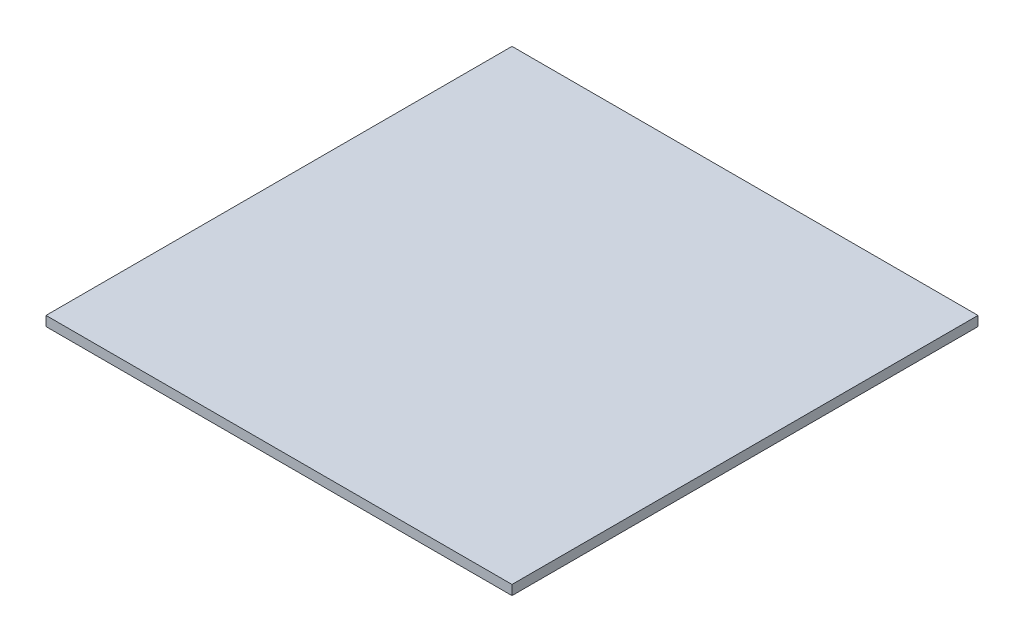
ISO-10303-21;
HEADER;
FILE_DESCRIPTION(('STEP AP214'),'2;1');
FILE_NAME('part.step','',(''),(''),'','','');
FILE_SCHEMA(('AUTOMOTIVE_DESIGN { 1 0 10303 214 1 1 1 1 }'));
ENDSEC;
DATA;
#1=APPLICATION_CONTEXT('core data for automotive mechanical design processes');
#2=APPLICATION_PROTOCOL_DEFINITION('international standard','automotive_design',2000,#1);
#3=PRODUCT_CONTEXT('',#1,'mechanical');
#4=PRODUCT('Part','Part','',(#3));
#5=PRODUCT_RELATED_PRODUCT_CATEGORY('part','',(#4));
#6=PRODUCT_DEFINITION_FORMATION('','',#4);
#7=PRODUCT_DEFINITION_CONTEXT('part definition',#1,'design');
#8=PRODUCT_DEFINITION('design','',#6,#7);
#9=PRODUCT_DEFINITION_SHAPE('','',#8);
#10=(LENGTH_UNIT() NAMED_UNIT(*) SI_UNIT(.MILLI.,.METRE.));
#11=(NAMED_UNIT(*) PLANE_ANGLE_UNIT() SI_UNIT($,.RADIAN.));
#12=(NAMED_UNIT(*) SI_UNIT($,.STERADIAN.) SOLID_ANGLE_UNIT());
#13=UNCERTAINTY_MEASURE_WITH_UNIT(LENGTH_MEASURE(1.E-05),#10,'distance_accuracy_value','');
#14=(GEOMETRIC_REPRESENTATION_CONTEXT(3) GLOBAL_UNCERTAINTY_ASSIGNED_CONTEXT((#13)) GLOBAL_UNIT_ASSIGNED_CONTEXT((#10,
#11,#12)) REPRESENTATION_CONTEXT('',''));
#15=CARTESIAN_POINT('',(0.,0.,0.));
#16=DIRECTION('',(0.,0.,1.));
#17=DIRECTION('',(1.,0.,0.));
#18=AXIS2_PLACEMENT_3D('',#15,#16,#17);
#19=CARTESIAN_POINT('',(-152.4,6.35,152.4));
#20=DIRECTION('',(1.,0.,0.));
#21=DIRECTION('',(0.,0.,-1.));
#22=AXIS2_PLACEMENT_3D('',#19,#20,#21);
#23=PLANE('',#22);
#24=DIRECTION('',(0.,0.,1.));
#25=VECTOR('',#24,1.);
#26=CARTESIAN_POINT('',(-152.4,0.,152.4));
#27=LINE('',#26,#25);
#28=CARTESIAN_POINT('',(-152.4,0.,-152.4));
#29=VERTEX_POINT('',#28);
#30=CARTESIAN_POINT('',(-152.4,0.,152.4));
#31=VERTEX_POINT('',#30);
#32=EDGE_CURVE('E100',#29,#31,#27,.T.);
#33=ORIENTED_EDGE('',*,*,#32,.T.);
#34=DIRECTION('',(0.,-1.,0.));
#35=VECTOR('',#34,1.);
#36=CARTESIAN_POINT('',(-152.4,6.35,152.4));
#37=LINE('',#36,#35);
#38=CARTESIAN_POINT('',(-152.4,6.35,152.4));
#39=VERTEX_POINT('',#38);
#40=EDGE_CURVE('E11',#39,#31,#37,.T.);
#41=ORIENTED_EDGE('',*,*,#40,.F.);
#42=DIRECTION('',(0.,0.,1.));
#43=VECTOR('',#42,1.);
#44=CARTESIAN_POINT('',(-152.4,6.35,152.4));
#45=LINE('',#44,#43);
#46=CARTESIAN_POINT('',(-152.4,6.35,-152.4));
#47=VERTEX_POINT('',#46);
#48=EDGE_CURVE('E88',#47,#39,#45,.T.);
#49=ORIENTED_EDGE('',*,*,#48,.F.);
#50=DIRECTION('',(0.,-1.,0.));
#51=VECTOR('',#50,1.);
#52=CARTESIAN_POINT('',(-152.4,6.35,-152.4));
#53=LINE('',#52,#51);
#54=EDGE_CURVE('E96',#47,#29,#53,.T.);
#55=ORIENTED_EDGE('',*,*,#54,.T.);
#56=EDGE_LOOP('',(#33,#41,#49,#55));
#57=FACE_BOUND('',#56,.T.);
#58=ADVANCED_FACE('F37',(#57),#23,.F.);
#59=CARTESIAN_POINT('',(-152.4,6.35,152.4));
#60=DIRECTION('',(0.,0.,-1.));
#61=DIRECTION('',(-1.,0.,0.));
#62=AXIS2_PLACEMENT_3D('',#59,#60,#61);
#63=PLANE('',#62);
#64=DIRECTION('',(1.,0.,0.));
#65=VECTOR('',#64,1.);
#66=CARTESIAN_POINT('',(-152.4,0.,152.4));
#67=LINE('',#66,#65);
#68=CARTESIAN_POINT('',(152.4,0.,152.4));
#69=VERTEX_POINT('',#68);
#70=EDGE_CURVE('E92',#31,#69,#67,.T.);
#71=ORIENTED_EDGE('',*,*,#70,.T.);
#72=DIRECTION('',(0.,-1.,0.));
#73=VECTOR('',#72,1.);
#74=CARTESIAN_POINT('',(152.4,6.35,152.4));
#75=LINE('',#74,#73);
#76=CARTESIAN_POINT('',(152.4,6.35,152.4));
#77=VERTEX_POINT('',#76);
#78=EDGE_CURVE('E45',#77,#69,#75,.T.);
#79=ORIENTED_EDGE('',*,*,#78,.F.);
#80=DIRECTION('',(1.,0.,0.));
#81=VECTOR('',#80,1.);
#82=CARTESIAN_POINT('',(-152.4,6.35,152.4));
#83=LINE('',#82,#81);
#84=EDGE_CURVE('E83',#39,#77,#83,.T.);
#85=ORIENTED_EDGE('',*,*,#84,.F.);
#86=ORIENTED_EDGE('',*,*,#40,.T.);
#87=EDGE_LOOP('',(#71,#79,#85,#86));
#88=FACE_BOUND('',#87,.T.);
#89=ADVANCED_FACE('F91',(#88),#63,.F.);
#90=CARTESIAN_POINT('',(152.4,6.35,152.4));
#91=DIRECTION('',(-1.,0.,0.));
#92=DIRECTION('',(0.,0.,1.));
#93=AXIS2_PLACEMENT_3D('',#90,#91,#92);
#94=PLANE('',#93);
#95=DIRECTION('',(0.,0.,-1.));
#96=VECTOR('',#95,1.);
#97=CARTESIAN_POINT('',(152.4,0.,152.4));
#98=LINE('',#97,#96);
#99=CARTESIAN_POINT('',(152.4,0.,-152.4));
#100=VERTEX_POINT('',#99);
#101=EDGE_CURVE('E70',#69,#100,#98,.T.);
#102=ORIENTED_EDGE('',*,*,#101,.T.);
#103=DIRECTION('',(0.,-1.,0.));
#104=VECTOR('',#103,1.);
#105=CARTESIAN_POINT('',(152.4,6.35,-152.4));
#106=LINE('',#105,#104);
#107=CARTESIAN_POINT('',(152.4,6.35,-152.4));
#108=VERTEX_POINT('',#107);
#109=EDGE_CURVE('E93',#108,#100,#106,.T.);
#110=ORIENTED_EDGE('',*,*,#109,.F.);
#111=DIRECTION('',(0.,0.,-1.));
#112=VECTOR('',#111,1.);
#113=CARTESIAN_POINT('',(152.4,6.35,152.4));
#114=LINE('',#113,#112);
#115=EDGE_CURVE('E86',#77,#108,#114,.T.);
#116=ORIENTED_EDGE('',*,*,#115,.F.);
#117=ORIENTED_EDGE('',*,*,#78,.T.);
#118=EDGE_LOOP('',(#102,#110,#116,#117));
#119=FACE_BOUND('',#118,.T.);
#120=ADVANCED_FACE('F94',(#119),#94,.F.);
#121=CARTESIAN_POINT('',(-152.4,6.35,-152.4));
#122=DIRECTION('',(0.,0.,1.));
#123=DIRECTION('',(1.,0.,0.));
#124=AXIS2_PLACEMENT_3D('',#121,#122,#123);
#125=PLANE('',#124);
#126=DIRECTION('',(-1.,0.,0.));
#127=VECTOR('',#126,1.);
#128=CARTESIAN_POINT('',(-152.4,0.,-152.4));
#129=LINE('',#128,#127);
#130=EDGE_CURVE('E76',#100,#29,#129,.T.);
#131=ORIENTED_EDGE('',*,*,#130,.T.);
#132=ORIENTED_EDGE('',*,*,#54,.F.);
#133=DIRECTION('',(-1.,0.,0.));
#134=VECTOR('',#133,1.);
#135=CARTESIAN_POINT('',(-152.4,6.35,-152.4));
#136=LINE('',#135,#134);
#137=EDGE_CURVE('E53',#108,#47,#136,.T.);
#138=ORIENTED_EDGE('',*,*,#137,.F.);
#139=ORIENTED_EDGE('',*,*,#109,.T.);
#140=EDGE_LOOP('',(#131,#132,#138,#139));
#141=FACE_BOUND('',#140,.T.);
#142=ADVANCED_FACE('F107',(#141),#125,.F.);
#143=CARTESIAN_POINT('',(0.,6.35,0.));
#144=DIRECTION('',(0.,-1.,0.));
#145=DIRECTION('',(0.,0.,-1.));
#146=AXIS2_PLACEMENT_3D('',#143,#144,#145);
#147=PLANE('',#146);
#148=ORIENTED_EDGE('',*,*,#48,.T.);
#149=ORIENTED_EDGE('',*,*,#84,.T.);
#150=ORIENTED_EDGE('',*,*,#115,.T.);
#151=ORIENTED_EDGE('',*,*,#137,.T.);
#152=EDGE_LOOP('',(#148,#149,#150,#151));
#153=FACE_BOUND('',#152,.T.);
#154=ADVANCED_FACE('F84',(#153),#147,.F.);
#155=CARTESIAN_POINT('',(0.,0.,0.));
#156=DIRECTION('',(0.,-1.,0.));
#157=DIRECTION('',(0.,0.,-1.));
#158=AXIS2_PLACEMENT_3D('',#155,#156,#157);
#159=PLANE('',#158);
#160=ORIENTED_EDGE('',*,*,#32,.F.);
#161=ORIENTED_EDGE('',*,*,#130,.F.);
#162=ORIENTED_EDGE('',*,*,#101,.F.);
#163=ORIENTED_EDGE('',*,*,#70,.F.);
#164=EDGE_LOOP('',(#160,#161,#162,#163));
#165=FACE_BOUND('',#164,.T.);
#166=ADVANCED_FACE('F110',(#165),#159,.T.);
#167=CLOSED_SHELL('',(#58,#89,#120,#142,#154,#166));
#168=MANIFOLD_SOLID_BREP('B2',#167);
#169=ADVANCED_BREP_SHAPE_REPRESENTATION('',(#18,#168),#14);
#170=SHAPE_DEFINITION_REPRESENTATION(#9,#169);
ENDSEC;
END-ISO-10303-21;
